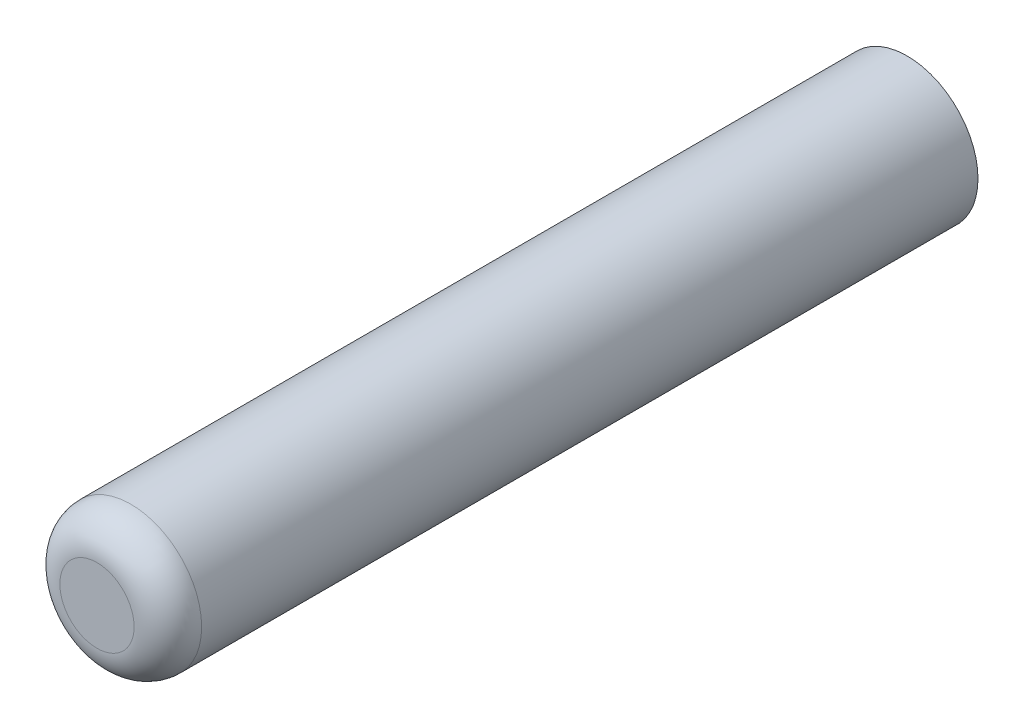
ISO-10303-21;
HEADER;
FILE_DESCRIPTION(('STEP AP214'),'2;1');
FILE_NAME('part.step','',(''),(''),'','','');
FILE_SCHEMA(('AUTOMOTIVE_DESIGN { 1 0 10303 214 1 1 1 1 }'));
ENDSEC;
DATA;
#1=APPLICATION_CONTEXT('core data for automotive mechanical design processes');
#2=APPLICATION_PROTOCOL_DEFINITION('international standard','automotive_design',2000,#1);
#3=PRODUCT_CONTEXT('',#1,'mechanical');
#4=PRODUCT('Part','Part','',(#3));
#5=PRODUCT_RELATED_PRODUCT_CATEGORY('part','',(#4));
#6=PRODUCT_DEFINITION_FORMATION('','',#4);
#7=PRODUCT_DEFINITION_CONTEXT('part definition',#1,'design');
#8=PRODUCT_DEFINITION('design','',#6,#7);
#9=PRODUCT_DEFINITION_SHAPE('','',#8);
#10=(LENGTH_UNIT() NAMED_UNIT(*) SI_UNIT(.MILLI.,.METRE.));
#11=(NAMED_UNIT(*) PLANE_ANGLE_UNIT() SI_UNIT($,.RADIAN.));
#12=(NAMED_UNIT(*) SI_UNIT($,.STERADIAN.) SOLID_ANGLE_UNIT());
#13=UNCERTAINTY_MEASURE_WITH_UNIT(LENGTH_MEASURE(1.E-05),#10,'distance_accuracy_value','');
#14=(GEOMETRIC_REPRESENTATION_CONTEXT(3) GLOBAL_UNCERTAINTY_ASSIGNED_CONTEXT((#13)) GLOBAL_UNIT_ASSIGNED_CONTEXT((#10,
#11,#12)) REPRESENTATION_CONTEXT('',''));
#15=CARTESIAN_POINT('',(0.,0.,0.));
#16=DIRECTION('',(0.,0.,1.));
#17=DIRECTION('',(1.,0.,0.));
#18=AXIS2_PLACEMENT_3D('',#15,#16,#17);
#19=CARTESIAN_POINT('',(0.,0.,12.));
#20=DIRECTION('',(0.,0.,-1.));
#21=DIRECTION('',(-1.,0.,0.));
#22=AXIS2_PLACEMENT_3D('',#19,#20,#21);
#23=CYLINDRICAL_SURFACE('',#22,1.05);
#24=CARTESIAN_POINT('',(0.,0.,11.5));
#25=DIRECTION('',(0.,0.,1.));
#26=DIRECTION('',(1.,0.,0.));
#27=AXIS2_PLACEMENT_3D('',#24,#25,#26);
#28=CIRCLE('',#27,1.05);
#29=CARTESIAN_POINT('',(1.05,0.,11.5));
#30=VERTEX_POINT('',#29);
#31=EDGE_CURVE('E10',#30,#30,#28,.F.);
#32=ORIENTED_EDGE('',*,*,#31,.T.);
#33=EDGE_LOOP('',(#32));
#34=FACE_BOUND('',#33,.T.);
#35=CARTESIAN_POINT('',(0.,0.,0.));
#36=DIRECTION('',(0.,0.,1.));
#37=DIRECTION('',(1.,0.,0.));
#38=AXIS2_PLACEMENT_3D('',#35,#36,#37);
#39=CIRCLE('',#38,1.05);
#40=CARTESIAN_POINT('',(1.05,0.,0.));
#41=VERTEX_POINT('',#40);
#42=EDGE_CURVE('E41',#41,#41,#39,.T.);
#43=ORIENTED_EDGE('',*,*,#42,.T.);
#44=EDGE_LOOP('',(#43));
#45=FACE_BOUND('',#44,.T.);
#46=ADVANCED_FACE('F30',(#34,#45),#23,.T.);
#47=CARTESIAN_POINT('',(0.,0.,12.));
#48=DIRECTION('',(0.,0.,1.));
#49=DIRECTION('',(1.,0.,0.));
#50=AXIS2_PLACEMENT_3D('',#47,#48,#49);
#51=PLANE('',#50);
#52=CARTESIAN_POINT('',(0.,0.,12.));
#53=DIRECTION('',(0.,0.,1.));
#54=DIRECTION('',(1.,0.,0.));
#55=AXIS2_PLACEMENT_3D('',#52,#53,#54);
#56=CIRCLE('',#55,0.55);
#57=CARTESIAN_POINT('',(0.55,0.,12.));
#58=VERTEX_POINT('',#57);
#59=EDGE_CURVE('E37',#58,#58,#56,.T.);
#60=ORIENTED_EDGE('',*,*,#59,.T.);
#61=EDGE_LOOP('',(#60));
#62=FACE_BOUND('',#61,.T.);
#63=ADVANCED_FACE('F51',(#62),#51,.T.);
#64=CARTESIAN_POINT('',(0.,0.,0.));
#65=DIRECTION('',(0.,0.,1.));
#66=DIRECTION('',(1.,0.,0.));
#67=AXIS2_PLACEMENT_3D('',#64,#65,#66);
#68=PLANE('',#67);
#69=ORIENTED_EDGE('',*,*,#42,.F.);
#70=EDGE_LOOP('',(#69));
#71=FACE_BOUND('',#70,.T.);
#72=ADVANCED_FACE('F49',(#71),#68,.F.);
#73=CARTESIAN_POINT('',(0.,0.,11.5));
#74=DIRECTION('',(0.,0.,1.));
#75=DIRECTION('',(1.,0.,0.));
#76=AXIS2_PLACEMENT_3D('',#73,#74,#75);
#77=TOROIDAL_SURFACE('',#76,0.55,0.5);
#78=ORIENTED_EDGE('',*,*,#31,.F.);
#79=EDGE_LOOP('',(#78));
#80=FACE_BOUND('',#79,.T.);
#81=ORIENTED_EDGE('',*,*,#59,.F.);
#82=EDGE_LOOP('',(#81));
#83=FACE_BOUND('',#82,.T.);
#84=ADVANCED_FACE('F32',(#80,#83),#77,.T.);
#85=CLOSED_SHELL('',(#46,#63,#72,#84));
#86=MANIFOLD_SOLID_BREP('B2',#85);
#87=ADVANCED_BREP_SHAPE_REPRESENTATION('',(#18,#86),#14);
#88=SHAPE_DEFINITION_REPRESENTATION(#9,#87);
ENDSEC;
END-ISO-10303-21;
